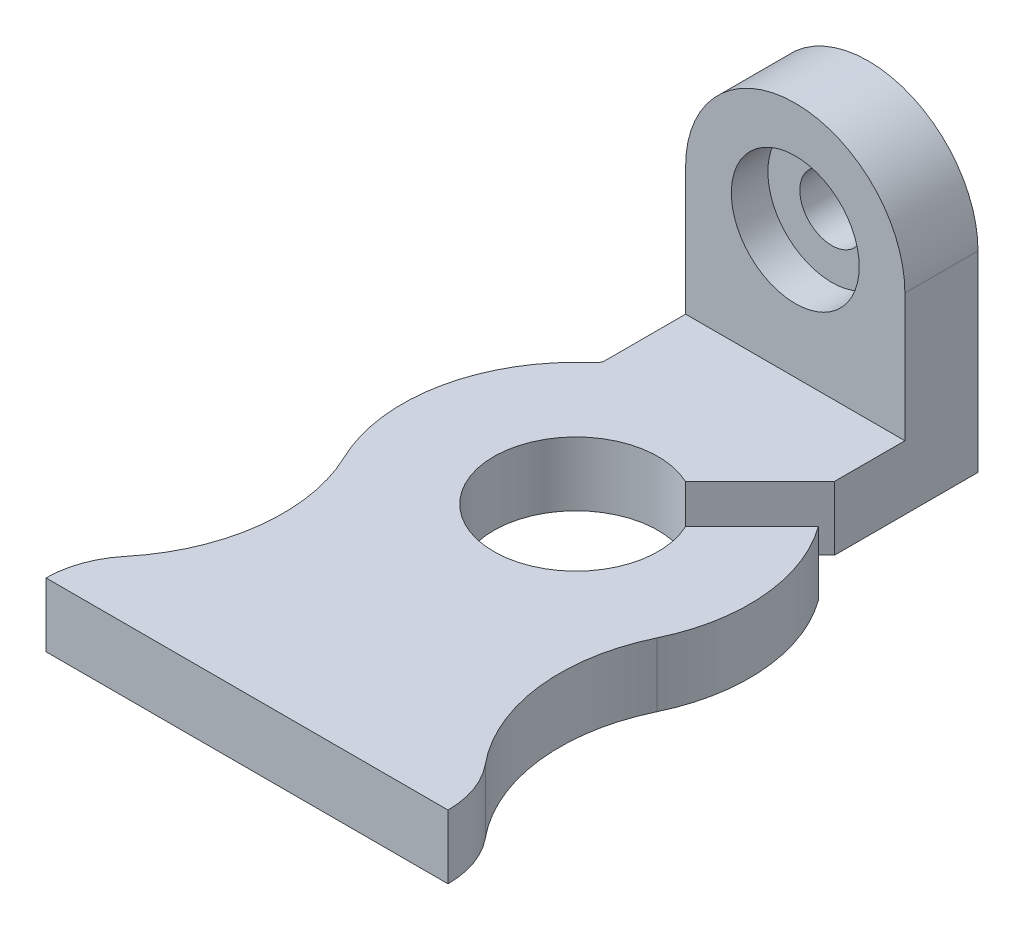
ISO-10303-21;
HEADER;
FILE_DESCRIPTION(('STEP AP214'),'2;1');
FILE_NAME('part.step','',(''),(''),'','','');
FILE_SCHEMA(('AUTOMOTIVE_DESIGN { 1 0 10303 214 1 1 1 1 }'));
ENDSEC;
DATA;
#1=APPLICATION_CONTEXT('core data for automotive mechanical design processes');
#2=APPLICATION_PROTOCOL_DEFINITION('international standard','automotive_design',2000,#1);
#3=PRODUCT_CONTEXT('',#1,'mechanical');
#4=PRODUCT('Part','Part','',(#3));
#5=PRODUCT_RELATED_PRODUCT_CATEGORY('part','',(#4));
#6=PRODUCT_DEFINITION_FORMATION('','',#4);
#7=PRODUCT_DEFINITION_CONTEXT('part definition',#1,'design');
#8=PRODUCT_DEFINITION('design','',#6,#7);
#9=PRODUCT_DEFINITION_SHAPE('','',#8);
#10=(LENGTH_UNIT() NAMED_UNIT(*) SI_UNIT(.MILLI.,.METRE.));
#11=(NAMED_UNIT(*) PLANE_ANGLE_UNIT() SI_UNIT($,.RADIAN.));
#12=(NAMED_UNIT(*) SI_UNIT($,.STERADIAN.) SOLID_ANGLE_UNIT());
#13=UNCERTAINTY_MEASURE_WITH_UNIT(LENGTH_MEASURE(1.E-05),#10,'distance_accuracy_value','');
#14=(GEOMETRIC_REPRESENTATION_CONTEXT(3) GLOBAL_UNCERTAINTY_ASSIGNED_CONTEXT((#13)) GLOBAL_UNIT_ASSIGNED_CONTEXT((#10,
#11,#12)) REPRESENTATION_CONTEXT('',''));
#15=CARTESIAN_POINT('',(0.,0.,0.));
#16=DIRECTION('',(0.,0.,1.));
#17=DIRECTION('',(1.,0.,0.));
#18=AXIS2_PLACEMENT_3D('',#15,#16,#17);
#19=CARTESIAN_POINT('',(0.,22.225,-114.3));
#20=DIRECTION('',(0.,-1.,0.));
#21=DIRECTION('',(0.,0.,-1.));
#22=AXIS2_PLACEMENT_3D('',#19,#20,#21);
#23=CYLINDRICAL_SURFACE('',#22,60.325);
#24=DIRECTION('',(0.,-1.,0.));
#25=VECTOR('',#24,1.);
#26=CARTESIAN_POINT('',(48.9316718006548,22.225,-149.58168249663));
#27=LINE('',#26,#25);
#28=CARTESIAN_POINT('',(48.9316718006548,22.225,-149.58168249663));
#29=VERTEX_POINT('',#28);
#30=CARTESIAN_POINT('',(48.9316718006548,0.,-149.58168249663));
#31=VERTEX_POINT('',#30);
#32=EDGE_CURVE('E383',#29,#31,#27,.T.);
#33=ORIENTED_EDGE('',*,*,#32,.F.);
#34=CARTESIAN_POINT('',(0.,22.225,-114.3));
#35=DIRECTION('',(0.,1.,0.));
#36=DIRECTION('',(0.,0.,1.));
#37=AXIS2_PLACEMENT_3D('',#34,#35,#36);
#38=CIRCLE('',#37,60.325);
#39=CARTESIAN_POINT('',(54.3589834488349,22.225,-88.1426579444834));
#40=VERTEX_POINT('',#39);
#41=EDGE_CURVE('E185',#40,#29,#38,.T.);
#42=ORIENTED_EDGE('',*,*,#41,.F.);
#43=DIRECTION('',(0.,-1.,0.));
#44=VECTOR('',#43,1.);
#45=CARTESIAN_POINT('',(54.3589834488349,22.225,-88.1426579444834));
#46=LINE('',#45,#44);
#47=CARTESIAN_POINT('',(54.3589834488349,0.,-88.1426579444834));
#48=VERTEX_POINT('',#47);
#49=EDGE_CURVE('E45',#40,#48,#46,.T.);
#50=ORIENTED_EDGE('',*,*,#49,.T.);
#51=CARTESIAN_POINT('',(0.,0.,-114.3));
#52=DIRECTION('',(0.,1.,0.));
#53=DIRECTION('',(0.,0.,1.));
#54=AXIS2_PLACEMENT_3D('',#51,#52,#53);
#55=CIRCLE('',#54,60.325);
#56=EDGE_CURVE('E253',#48,#31,#55,.T.);
#57=ORIENTED_EDGE('',*,*,#56,.T.);
#58=EDGE_LOOP('',(#33,#42,#50,#57));
#59=FACE_BOUND('',#58,.T.);
#60=ADVANCED_FACE('F35',(#59),#23,.T.);
#61=CARTESIAN_POINT('',(0.,66.675,-190.5));
#62=DIRECTION('',(0.,0.,-1.));
#63=DIRECTION('',(-1.,0.,0.));
#64=AXIS2_PLACEMENT_3D('',#61,#62,#63);
#65=CYLINDRICAL_SURFACE('',#64,11.1125);
#66=CARTESIAN_POINT('',(0.,66.675,-215.9));
#67=DIRECTION('',(0.,0.,-1.));
#68=DIRECTION('',(-1.,0.,0.));
#69=AXIS2_PLACEMENT_3D('',#66,#67,#68);
#70=CIRCLE('',#69,11.1125);
#71=CARTESIAN_POINT('',(-11.1125,66.675,-215.9));
#72=VERTEX_POINT('',#71);
#73=EDGE_CURVE('E212',#72,#72,#70,.T.);
#74=ORIENTED_EDGE('',*,*,#73,.T.);
#75=EDGE_LOOP('',(#74));
#76=FACE_BOUND('',#75,.T.);
#77=CARTESIAN_POINT('',(0.,66.675,-203.2));
#78=DIRECTION('',(0.,0.,1.));
#79=DIRECTION('',(1.,0.,0.));
#80=AXIS2_PLACEMENT_3D('',#77,#78,#79);
#81=CIRCLE('',#80,11.1125);
#82=CARTESIAN_POINT('',(11.1125,66.675,-203.2));
#83=VERTEX_POINT('',#82);
#84=EDGE_CURVE('E216',#83,#83,#81,.F.);
#85=ORIENTED_EDGE('',*,*,#84,.F.);
#86=EDGE_LOOP('',(#85));
#87=FACE_BOUND('',#86,.T.);
#88=ADVANCED_FACE('F335',(#76,#87),#65,.F.);
#89=CARTESIAN_POINT('',(38.1,22.225,0.));
#90=DIRECTION('',(0.,1.,0.));
#91=DIRECTION('',(0.,0.,1.));
#92=AXIS2_PLACEMENT_3D('',#89,#90,#91);
#93=PLANE('',#92);
#94=DIRECTION('',(-0.707106781186546,0.,0.707106781186549));
#95=VECTOR('',#94,1.);
#96=CARTESIAN_POINT('',(-63.9749946520126,22.225,-63.9749946520123));
#97=LINE('',#96,#95);
#98=CARTESIAN_POINT('',(38.1,22.225,-166.049989304025));
#99=VERTEX_POINT('',#98);
#100=CARTESIAN_POINT('',(12.193016823954,22.225,-140.143006127979));
#101=VERTEX_POINT('',#100);
#102=EDGE_CURVE('E61',#99,#101,#97,.T.);
#103=ORIENTED_EDGE('',*,*,#102,.F.);
#104=DIRECTION('',(0.,0.,-1.));
#105=VECTOR('',#104,1.);
#106=CARTESIAN_POINT('',(38.1,22.225,-215.9));
#107=LINE('',#106,#105);
#108=CARTESIAN_POINT('',(38.1,22.225,-190.5));
#109=VERTEX_POINT('',#108);
#110=EDGE_CURVE('E39',#99,#109,#107,.T.);
#111=ORIENTED_EDGE('',*,*,#110,.T.);
#112=DIRECTION('',(1.,0.,0.));
#113=VECTOR('',#112,1.);
#114=CARTESIAN_POINT('',(0.,22.225,-190.5));
#115=LINE('',#114,#113);
#116=CARTESIAN_POINT('',(-38.1,22.225,-190.5));
#117=VERTEX_POINT('',#116);
#118=EDGE_CURVE('E199',#117,#109,#115,.T.);
#119=ORIENTED_EDGE('',*,*,#118,.F.);
#120=DIRECTION('',(0.,0.,1.));
#121=VECTOR('',#120,1.);
#122=CARTESIAN_POINT('',(-38.1,22.225,-215.9));
#123=LINE('',#122,#121);
#124=CARTESIAN_POINT('',(-38.1,22.225,-162.555822187587));
#125=VERTEX_POINT('',#124);
#126=EDGE_CURVE('E194',#117,#125,#123,.T.);
#127=ORIENTED_EDGE('',*,*,#126,.T.);
#128=CARTESIAN_POINT('',(-41.275,22.225,-162.555822187587));
#129=DIRECTION('',(0.,-1.,0.));
#130=DIRECTION('',(0.,0.,1.));
#131=AXIS2_PLACEMENT_3D('',#128,#129,#130);
#132=CIRCLE('',#131,3.17500000000001);
#133=CARTESIAN_POINT('',(-39.21125,22.225,-160.143031078207));
#134=VERTEX_POINT('',#133);
#135=EDGE_CURVE('E191',#125,#134,#132,.T.);
#136=ORIENTED_EDGE('',*,*,#135,.T.);
#137=CARTESIAN_POINT('',(0.,22.225,-114.3));
#138=DIRECTION('',(0.,1.,0.));
#139=DIRECTION('',(0.,0.,-1.));
#140=AXIS2_PLACEMENT_3D('',#137,#138,#139);
#141=CIRCLE('',#140,60.325);
#142=CARTESIAN_POINT('',(-54.3589834488349,22.225,-88.1426579444834));
#143=VERTEX_POINT('',#142);
#144=EDGE_CURVE('E293',#134,#143,#141,.T.);
#145=ORIENTED_EDGE('',*,*,#144,.T.);
#146=CARTESIAN_POINT('',(-111.578966026556,22.225,-60.6086136755186));
#147=DIRECTION('',(0.,-1.,0.));
#148=DIRECTION('',(0.,0.,-1.));
#149=AXIS2_PLACEMENT_3D('',#146,#147,#148);
#150=CIRCLE('',#149,63.5);
#151=CARTESIAN_POINT('',(-62.5929886755186,22.225,-20.2028712251729));
#152=VERTEX_POINT('',#151);
#153=EDGE_CURVE('E311',#143,#152,#150,.T.);
#154=ORIENTED_EDGE('',*,*,#153,.T.);
#155=CARTESIAN_POINT('',(-38.1,22.225,0.));
#156=DIRECTION('',(0.,1.,0.));
#157=DIRECTION('',(0.,0.,-1.));
#158=AXIS2_PLACEMENT_3D('',#155,#156,#157);
#159=CIRCLE('',#158,31.75);
#160=CARTESIAN_POINT('',(-69.85,22.225,0.));
#161=VERTEX_POINT('',#160);
#162=EDGE_CURVE('E308',#152,#161,#159,.T.);
#163=ORIENTED_EDGE('',*,*,#162,.T.);
#164=DIRECTION('',(1.,0.,0.));
#165=VECTOR('',#164,1.);
#166=CARTESIAN_POINT('',(-69.85,22.225,0.));
#167=LINE('',#166,#165);
#168=CARTESIAN_POINT('',(69.85,22.225,0.));
#169=VERTEX_POINT('',#168);
#170=EDGE_CURVE('E278',#161,#169,#167,.T.);
#171=ORIENTED_EDGE('',*,*,#170,.T.);
#172=CARTESIAN_POINT('',(38.1,22.225,0.));
#173=DIRECTION('',(0.,1.,0.));
#174=DIRECTION('',(0.,0.,1.));
#175=AXIS2_PLACEMENT_3D('',#172,#173,#174);
#176=CIRCLE('',#175,31.75);
#177=CARTESIAN_POINT('',(62.5929886755186,22.225,-20.2028712251729));
#178=VERTEX_POINT('',#177);
#179=EDGE_CURVE('E179',#169,#178,#176,.T.);
#180=ORIENTED_EDGE('',*,*,#179,.T.);
#181=CARTESIAN_POINT('',(111.578966026556,22.225,-60.6086136755186));
#182=DIRECTION('',(0.,-1.,0.));
#183=DIRECTION('',(0.,0.,1.));
#184=AXIS2_PLACEMENT_3D('',#181,#182,#183);
#185=CIRCLE('',#184,63.5);
#186=EDGE_CURVE('E182',#178,#40,#185,.T.);
#187=ORIENTED_EDGE('',*,*,#186,.T.);
#188=ORIENTED_EDGE('',*,*,#41,.T.);
#189=DIRECTION('',(-0.707106781186546,0.,0.707106781186549));
#190=VECTOR('',#189,1.);
#191=CARTESIAN_POINT('',(-50.3250053479874,22.225,-50.3250053479872));
#192=LINE('',#191,#190);
#193=CARTESIAN_POINT('',(25.8430061279792,22.225,-126.493016823954));
#194=VERTEX_POINT('',#193);
#195=EDGE_CURVE('E166',#29,#194,#192,.T.);
#196=ORIENTED_EDGE('',*,*,#195,.T.);
#197=CARTESIAN_POINT('',(0.,22.225,-114.3));
#198=DIRECTION('',(0.,1.,0.));
#199=DIRECTION('',(0.,0.,1.));
#200=AXIS2_PLACEMENT_3D('',#197,#198,#199);
#201=CIRCLE('',#200,28.575);
#202=EDGE_CURVE('E169',#101,#194,#201,.T.);
#203=ORIENTED_EDGE('',*,*,#202,.F.);
#204=EDGE_LOOP('',(#103,#111,#119,#127,#136,#145,#154,#163,#171,#180,#187,#188,#196,#203));
#205=FACE_BOUND('',#204,.T.);
#206=ADVANCED_FACE('F322',(#205),#93,.T.);
#207=CARTESIAN_POINT('',(38.1,0.,0.));
#208=DIRECTION('',(0.,1.,0.));
#209=DIRECTION('',(0.,0.,1.));
#210=AXIS2_PLACEMENT_3D('',#207,#208,#209);
#211=PLANE('',#210);
#212=DIRECTION('',(0.,0.,-1.));
#213=VECTOR('',#212,1.);
#214=CARTESIAN_POINT('',(38.1,0.,-215.9));
#215=LINE('',#214,#213);
#216=CARTESIAN_POINT('',(38.1,0.,-166.049989304025));
#217=VERTEX_POINT('',#216);
#218=CARTESIAN_POINT('',(38.1,0.,-215.9));
#219=VERTEX_POINT('',#218);
#220=EDGE_CURVE('E165',#217,#219,#215,.T.);
#221=ORIENTED_EDGE('',*,*,#220,.F.);
#222=DIRECTION('',(-0.707106781186546,0.,0.707106781186549));
#223=VECTOR('',#222,1.);
#224=CARTESIAN_POINT('',(-63.9749946520126,0.,-63.9749946520123));
#225=LINE('',#224,#223);
#226=CARTESIAN_POINT('',(12.193016823954,0.,-140.143006127979));
#227=VERTEX_POINT('',#226);
#228=EDGE_CURVE('E151',#217,#227,#225,.T.);
#229=ORIENTED_EDGE('',*,*,#228,.T.);
#230=CARTESIAN_POINT('',(0.,0.,-114.3));
#231=DIRECTION('',(0.,1.,0.));
#232=DIRECTION('',(0.,0.,1.));
#233=AXIS2_PLACEMENT_3D('',#230,#231,#232);
#234=CIRCLE('',#233,28.575);
#235=CARTESIAN_POINT('',(25.8430061279792,0.,-126.493016823954));
#236=VERTEX_POINT('',#235);
#237=EDGE_CURVE('E163',#227,#236,#234,.T.);
#238=ORIENTED_EDGE('',*,*,#237,.T.);
#239=DIRECTION('',(-0.707106781186546,0.,0.707106781186549));
#240=VECTOR('',#239,1.);
#241=CARTESIAN_POINT('',(-50.3250053479874,0.,-50.3250053479872));
#242=LINE('',#241,#240);
#243=EDGE_CURVE('E53',#31,#236,#242,.T.);
#244=ORIENTED_EDGE('',*,*,#243,.F.);
#245=ORIENTED_EDGE('',*,*,#56,.F.);
#246=CARTESIAN_POINT('',(111.578966026556,0.,-60.6086136755186));
#247=DIRECTION('',(0.,-1.,0.));
#248=DIRECTION('',(0.,0.,1.));
#249=AXIS2_PLACEMENT_3D('',#246,#247,#248);
#250=CIRCLE('',#249,63.5);
#251=CARTESIAN_POINT('',(62.5929886755186,0.,-20.2028712251729));
#252=VERTEX_POINT('',#251);
#253=EDGE_CURVE('E256',#252,#48,#250,.T.);
#254=ORIENTED_EDGE('',*,*,#253,.F.);
#255=CARTESIAN_POINT('',(38.1,0.,0.));
#256=DIRECTION('',(0.,1.,0.));
#257=DIRECTION('',(0.,0.,1.));
#258=AXIS2_PLACEMENT_3D('',#255,#256,#257);
#259=CIRCLE('',#258,31.75);
#260=CARTESIAN_POINT('',(69.85,0.,0.));
#261=VERTEX_POINT('',#260);
#262=EDGE_CURVE('E172',#261,#252,#259,.T.);
#263=ORIENTED_EDGE('',*,*,#262,.F.);
#264=DIRECTION('',(1.,0.,0.));
#265=VECTOR('',#264,1.);
#266=CARTESIAN_POINT('',(-69.85,0.,0.));
#267=LINE('',#266,#265);
#268=CARTESIAN_POINT('',(-69.85,0.,0.));
#269=VERTEX_POINT('',#268);
#270=EDGE_CURVE('E183',#269,#261,#267,.T.);
#271=ORIENTED_EDGE('',*,*,#270,.F.);
#272=CARTESIAN_POINT('',(-38.1,0.,0.));
#273=DIRECTION('',(0.,1.,0.));
#274=DIRECTION('',(0.,0.,-1.));
#275=AXIS2_PLACEMENT_3D('',#272,#273,#274);
#276=CIRCLE('',#275,31.75);
#277=CARTESIAN_POINT('',(-62.5929886755186,0.,-20.2028712251729));
#278=VERTEX_POINT('',#277);
#279=EDGE_CURVE('E271',#278,#269,#276,.T.);
#280=ORIENTED_EDGE('',*,*,#279,.F.);
#281=CARTESIAN_POINT('',(-111.578966026556,0.,-60.6086136755186));
#282=DIRECTION('',(0.,-1.,0.));
#283=DIRECTION('',(0.,0.,-1.));
#284=AXIS2_PLACEMENT_3D('',#281,#282,#283);
#285=CIRCLE('',#284,63.5);
#286=CARTESIAN_POINT('',(-54.3589834488349,0.,-88.1426579444834));
#287=VERTEX_POINT('',#286);
#288=EDGE_CURVE('E269',#287,#278,#285,.T.);
#289=ORIENTED_EDGE('',*,*,#288,.F.);
#290=CARTESIAN_POINT('',(0.,0.,-114.3));
#291=DIRECTION('',(0.,1.,0.));
#292=DIRECTION('',(0.,0.,-1.));
#293=AXIS2_PLACEMENT_3D('',#290,#291,#292);
#294=CIRCLE('',#293,60.325);
#295=CARTESIAN_POINT('',(-39.21125,0.,-160.143031078207));
#296=VERTEX_POINT('',#295);
#297=EDGE_CURVE('E267',#296,#287,#294,.T.);
#298=ORIENTED_EDGE('',*,*,#297,.F.);
#299=CARTESIAN_POINT('',(-41.275,0.,-162.555822187587));
#300=DIRECTION('',(0.,-1.,0.));
#301=DIRECTION('',(0.,0.,1.));
#302=AXIS2_PLACEMENT_3D('',#299,#300,#301);
#303=CIRCLE('',#302,3.17500000000001);
#304=CARTESIAN_POINT('',(-38.1,0.,-162.555822187587));
#305=VERTEX_POINT('',#304);
#306=EDGE_CURVE('E265',#305,#296,#303,.T.);
#307=ORIENTED_EDGE('',*,*,#306,.F.);
#308=DIRECTION('',(0.,0.,1.));
#309=VECTOR('',#308,1.);
#310=CARTESIAN_POINT('',(-38.1,0.,-215.9));
#311=LINE('',#310,#309);
#312=CARTESIAN_POINT('',(-38.1,0.,-215.9));
#313=VERTEX_POINT('',#312);
#314=EDGE_CURVE('E263',#313,#305,#311,.T.);
#315=ORIENTED_EDGE('',*,*,#314,.F.);
#316=DIRECTION('',(-1.,0.,0.));
#317=VECTOR('',#316,1.);
#318=CARTESIAN_POINT('',(-38.1,0.,-215.9));
#319=LINE('',#318,#317);
#320=EDGE_CURVE('E238',#219,#313,#319,.T.);
#321=ORIENTED_EDGE('',*,*,#320,.F.);
#322=EDGE_LOOP('',(#221,#229,#238,#244,#245,#254,#263,#271,#280,#289,#298,#307,#315,#321));
#323=FACE_BOUND('',#322,.T.);
#324=ADVANCED_FACE('F162',(#323),#211,.F.);
#325=CARTESIAN_POINT('',(38.1,22.225,0.));
#326=DIRECTION('',(0.,-1.,0.));
#327=DIRECTION('',(0.,0.,-1.));
#328=AXIS2_PLACEMENT_3D('',#325,#326,#327);
#329=CYLINDRICAL_SURFACE('',#328,31.75);
#330=ORIENTED_EDGE('',*,*,#262,.T.);
#331=DIRECTION('',(0.,-1.,0.));
#332=VECTOR('',#331,1.);
#333=CARTESIAN_POINT('',(62.5929886755186,22.225,-20.2028712251729));
#334=LINE('',#333,#332);
#335=EDGE_CURVE('E11',#178,#252,#334,.T.);
#336=ORIENTED_EDGE('',*,*,#335,.F.);
#337=ORIENTED_EDGE('',*,*,#179,.F.);
#338=DIRECTION('',(0.,-1.,0.));
#339=VECTOR('',#338,1.);
#340=CARTESIAN_POINT('',(69.85,22.225,0.));
#341=LINE('',#340,#339);
#342=EDGE_CURVE('E274',#169,#261,#341,.T.);
#343=ORIENTED_EDGE('',*,*,#342,.T.);
#344=EDGE_LOOP('',(#330,#336,#337,#343));
#345=FACE_BOUND('',#344,.T.);
#346=ADVANCED_FACE('F37',(#345),#329,.T.);
#347=CARTESIAN_POINT('',(111.578966026556,22.225,-60.6086136755186));
#348=DIRECTION('',(0.,-1.,0.));
#349=DIRECTION('',(0.,0.,-1.));
#350=AXIS2_PLACEMENT_3D('',#347,#348,#349);
#351=CYLINDRICAL_SURFACE('',#350,63.5);
#352=ORIENTED_EDGE('',*,*,#253,.T.);
#353=ORIENTED_EDGE('',*,*,#49,.F.);
#354=ORIENTED_EDGE('',*,*,#186,.F.);
#355=ORIENTED_EDGE('',*,*,#335,.T.);
#356=EDGE_LOOP('',(#352,#353,#354,#355));
#357=FACE_BOUND('',#356,.T.);
#358=ADVANCED_FACE('F324',(#357),#351,.F.);
#359=CARTESIAN_POINT('',(38.1,22.225,-215.9));
#360=DIRECTION('',(-1.,0.,0.));
#361=DIRECTION('',(0.,0.,1.));
#362=AXIS2_PLACEMENT_3D('',#359,#360,#361);
#363=PLANE('',#362);
#364=ORIENTED_EDGE('',*,*,#110,.F.);
#365=DIRECTION('',(0.,-1.,0.));
#366=VECTOR('',#365,1.);
#367=CARTESIAN_POINT('',(38.1,22.225,-166.049989304025));
#368=LINE('',#367,#366);
#369=EDGE_CURVE('E384',#99,#217,#368,.T.);
#370=ORIENTED_EDGE('',*,*,#369,.T.);
#371=ORIENTED_EDGE('',*,*,#220,.T.);
#372=DIRECTION('',(0.,-1.,0.));
#373=VECTOR('',#372,1.);
#374=CARTESIAN_POINT('',(38.1,22.225,-215.9));
#375=LINE('',#374,#373);
#376=CARTESIAN_POINT('',(38.1,66.675,-215.9));
#377=VERTEX_POINT('',#376);
#378=EDGE_CURVE('E237',#377,#219,#375,.T.);
#379=ORIENTED_EDGE('',*,*,#378,.F.);
#380=DIRECTION('',(0.,0.,-1.));
#381=VECTOR('',#380,1.);
#382=CARTESIAN_POINT('',(38.1,66.675,-190.5));
#383=LINE('',#382,#381);
#384=CARTESIAN_POINT('',(38.1,66.675,-190.5));
#385=VERTEX_POINT('',#384);
#386=EDGE_CURVE('E170',#385,#377,#383,.T.);
#387=ORIENTED_EDGE('',*,*,#386,.F.);
#388=DIRECTION('',(0.,1.,0.));
#389=VECTOR('',#388,1.);
#390=CARTESIAN_POINT('',(38.1,0.,-190.5));
#391=LINE('',#390,#389);
#392=EDGE_CURVE('E197',#109,#385,#391,.T.);
#393=ORIENTED_EDGE('',*,*,#392,.F.);
#394=EDGE_LOOP('',(#364,#370,#371,#379,#387,#393));
#395=FACE_BOUND('',#394,.T.);
#396=ADVANCED_FACE('F326',(#395),#363,.F.);
#397=CARTESIAN_POINT('',(-38.1,22.225,-215.9));
#398=DIRECTION('',(0.,0.,1.));
#399=DIRECTION('',(1.,0.,0.));
#400=AXIS2_PLACEMENT_3D('',#397,#398,#399);
#401=PLANE('',#400);
#402=ORIENTED_EDGE('',*,*,#320,.T.);
#403=DIRECTION('',(0.,-1.,0.));
#404=VECTOR('',#403,1.);
#405=CARTESIAN_POINT('',(-38.1,22.225,-215.9));
#406=LINE('',#405,#404);
#407=CARTESIAN_POINT('',(-38.1,66.675,-215.9));
#408=VERTEX_POINT('',#407);
#409=EDGE_CURVE('E224',#408,#313,#406,.T.);
#410=ORIENTED_EDGE('',*,*,#409,.F.);
#411=CARTESIAN_POINT('',(0.,66.675,-215.9));
#412=DIRECTION('',(0.,0.,-1.));
#413=DIRECTION('',(-1.,0.,0.));
#414=AXIS2_PLACEMENT_3D('',#411,#412,#413);
#415=CIRCLE('',#414,38.1);
#416=EDGE_CURVE('E215',#408,#377,#415,.T.);
#417=ORIENTED_EDGE('',*,*,#416,.T.);
#418=ORIENTED_EDGE('',*,*,#378,.T.);
#419=EDGE_LOOP('',(#402,#410,#417,#418));
#420=FACE_BOUND('',#419,.T.);
#421=ORIENTED_EDGE('',*,*,#73,.F.);
#422=EDGE_LOOP('',(#421));
#423=FACE_BOUND('',#422,.T.);
#424=ADVANCED_FACE('F235',(#420,#423),#401,.F.);
#425=CARTESIAN_POINT('',(-38.1,22.225,-215.9));
#426=DIRECTION('',(1.,0.,0.));
#427=DIRECTION('',(0.,0.,-1.));
#428=AXIS2_PLACEMENT_3D('',#425,#426,#427);
#429=PLANE('',#428);
#430=ORIENTED_EDGE('',*,*,#314,.T.);
#431=DIRECTION('',(0.,-1.,0.));
#432=VECTOR('',#431,1.);
#433=CARTESIAN_POINT('',(-38.1,22.225,-162.555822187587));
#434=LINE('',#433,#432);
#435=EDGE_CURVE('E239',#125,#305,#434,.T.);
#436=ORIENTED_EDGE('',*,*,#435,.F.);
#437=ORIENTED_EDGE('',*,*,#126,.F.);
#438=DIRECTION('',(0.,1.,0.));
#439=VECTOR('',#438,1.);
#440=CARTESIAN_POINT('',(-38.1,0.,-190.5));
#441=LINE('',#440,#439);
#442=CARTESIAN_POINT('',(-38.1,66.675,-190.5));
#443=VERTEX_POINT('',#442);
#444=EDGE_CURVE('E206',#117,#443,#441,.T.);
#445=ORIENTED_EDGE('',*,*,#444,.T.);
#446=DIRECTION('',(0.,0.,-1.));
#447=VECTOR('',#446,1.);
#448=CARTESIAN_POINT('',(-38.1,66.675,-190.5));
#449=LINE('',#448,#447);
#450=EDGE_CURVE('E175',#443,#408,#449,.T.);
#451=ORIENTED_EDGE('',*,*,#450,.T.);
#452=ORIENTED_EDGE('',*,*,#409,.T.);
#453=EDGE_LOOP('',(#430,#436,#437,#445,#451,#452));
#454=FACE_BOUND('',#453,.T.);
#455=ADVANCED_FACE('F223',(#454),#429,.F.);
#456=CARTESIAN_POINT('',(-41.275,22.225,-162.555822187587));
#457=DIRECTION('',(0.,-1.,0.));
#458=DIRECTION('',(0.,0.,-1.));
#459=AXIS2_PLACEMENT_3D('',#456,#457,#458);
#460=CYLINDRICAL_SURFACE('',#459,3.17500000000001);
#461=ORIENTED_EDGE('',*,*,#306,.T.);
#462=DIRECTION('',(0.,-1.,0.));
#463=VECTOR('',#462,1.);
#464=CARTESIAN_POINT('',(-39.21125,22.225,-160.143031078207));
#465=LINE('',#464,#463);
#466=EDGE_CURVE('E243',#134,#296,#465,.T.);
#467=ORIENTED_EDGE('',*,*,#466,.F.);
#468=ORIENTED_EDGE('',*,*,#135,.F.);
#469=ORIENTED_EDGE('',*,*,#435,.T.);
#470=EDGE_LOOP('',(#461,#467,#468,#469));
#471=FACE_BOUND('',#470,.T.);
#472=ADVANCED_FACE('F346',(#471),#460,.F.);
#473=CARTESIAN_POINT('',(0.,22.225,-114.3));
#474=DIRECTION('',(0.,-1.,0.));
#475=DIRECTION('',(0.,0.,-1.));
#476=AXIS2_PLACEMENT_3D('',#473,#474,#475);
#477=CYLINDRICAL_SURFACE('',#476,60.325);
#478=ORIENTED_EDGE('',*,*,#297,.T.);
#479=DIRECTION('',(0.,-1.,0.));
#480=VECTOR('',#479,1.);
#481=CARTESIAN_POINT('',(-54.3589834488349,22.225,-88.1426579444834));
#482=LINE('',#481,#480);
#483=EDGE_CURVE('E284',#143,#287,#482,.T.);
#484=ORIENTED_EDGE('',*,*,#483,.F.);
#485=ORIENTED_EDGE('',*,*,#144,.F.);
#486=ORIENTED_EDGE('',*,*,#466,.T.);
#487=EDGE_LOOP('',(#478,#484,#485,#486));
#488=FACE_BOUND('',#487,.T.);
#489=ADVANCED_FACE('F291',(#488),#477,.T.);
#490=CARTESIAN_POINT('',(-111.578966026556,22.225,-60.6086136755186));
#491=DIRECTION('',(0.,-1.,0.));
#492=DIRECTION('',(0.,0.,-1.));
#493=AXIS2_PLACEMENT_3D('',#490,#491,#492);
#494=CYLINDRICAL_SURFACE('',#493,63.5);
#495=ORIENTED_EDGE('',*,*,#288,.T.);
#496=DIRECTION('',(0.,-1.,0.));
#497=VECTOR('',#496,1.);
#498=CARTESIAN_POINT('',(-62.5929886755186,22.225,-20.2028712251729));
#499=LINE('',#498,#497);
#500=EDGE_CURVE('E281',#152,#278,#499,.T.);
#501=ORIENTED_EDGE('',*,*,#500,.F.);
#502=ORIENTED_EDGE('',*,*,#153,.F.);
#503=ORIENTED_EDGE('',*,*,#483,.T.);
#504=EDGE_LOOP('',(#495,#501,#502,#503));
#505=FACE_BOUND('',#504,.T.);
#506=ADVANCED_FACE('F302',(#505),#494,.F.);
#507=CARTESIAN_POINT('',(-38.1,22.225,0.));
#508=DIRECTION('',(0.,-1.,0.));
#509=DIRECTION('',(0.,0.,-1.));
#510=AXIS2_PLACEMENT_3D('',#507,#508,#509);
#511=CYLINDRICAL_SURFACE('',#510,31.75);
#512=ORIENTED_EDGE('',*,*,#279,.T.);
#513=DIRECTION('',(0.,-1.,0.));
#514=VECTOR('',#513,1.);
#515=CARTESIAN_POINT('',(-69.85,22.225,0.));
#516=LINE('',#515,#514);
#517=EDGE_CURVE('E277',#161,#269,#516,.T.);
#518=ORIENTED_EDGE('',*,*,#517,.F.);
#519=ORIENTED_EDGE('',*,*,#162,.F.);
#520=ORIENTED_EDGE('',*,*,#500,.T.);
#521=EDGE_LOOP('',(#512,#518,#519,#520));
#522=FACE_BOUND('',#521,.T.);
#523=ADVANCED_FACE('F306',(#522),#511,.T.);
#524=CARTESIAN_POINT('',(-69.85,22.225,0.));
#525=DIRECTION('',(0.,0.,-1.));
#526=DIRECTION('',(-1.,0.,0.));
#527=AXIS2_PLACEMENT_3D('',#524,#525,#526);
#528=PLANE('',#527);
#529=ORIENTED_EDGE('',*,*,#270,.T.);
#530=ORIENTED_EDGE('',*,*,#342,.F.);
#531=ORIENTED_EDGE('',*,*,#170,.F.);
#532=ORIENTED_EDGE('',*,*,#517,.T.);
#533=EDGE_LOOP('',(#529,#530,#531,#532));
#534=FACE_BOUND('',#533,.T.);
#535=ADVANCED_FACE('F321',(#534),#528,.F.);
#536=CARTESIAN_POINT('',(0.,22.225,-114.3));
#537=DIRECTION('',(0.,-1.,0.));
#538=DIRECTION('',(0.,0.,-1.));
#539=AXIS2_PLACEMENT_3D('',#536,#537,#538);
#540=CYLINDRICAL_SURFACE('',#539,28.575);
#541=DIRECTION('',(0.,1.,0.));
#542=VECTOR('',#541,1.);
#543=CARTESIAN_POINT('',(12.193016823954,0.,-140.143006127979));
#544=LINE('',#543,#542);
#545=EDGE_CURVE('E148',#227,#101,#544,.T.);
#546=ORIENTED_EDGE('',*,*,#545,.T.);
#547=ORIENTED_EDGE('',*,*,#202,.T.);
#548=DIRECTION('',(0.,1.,0.));
#549=VECTOR('',#548,1.);
#550=CARTESIAN_POINT('',(25.8430061279792,0.,-126.493016823954));
#551=LINE('',#550,#549);
#552=EDGE_CURVE('E157',#236,#194,#551,.T.);
#553=ORIENTED_EDGE('',*,*,#552,.F.);
#554=ORIENTED_EDGE('',*,*,#237,.F.);
#555=EDGE_LOOP('',(#546,#547,#553,#554));
#556=FACE_BOUND('',#555,.T.);
#557=ADVANCED_FACE('F168',(#556),#540,.F.);
#558=CARTESIAN_POINT('',(0.,66.675,-190.5));
#559=DIRECTION('',(0.,0.,-1.));
#560=DIRECTION('',(-1.,0.,0.));
#561=AXIS2_PLACEMENT_3D('',#558,#559,#560);
#562=CYLINDRICAL_SURFACE('',#561,38.1);
#563=ORIENTED_EDGE('',*,*,#416,.F.);
#564=ORIENTED_EDGE('',*,*,#450,.F.);
#565=CARTESIAN_POINT('',(0.,66.675,-190.5));
#566=DIRECTION('',(0.,0.,-1.));
#567=DIRECTION('',(-1.,0.,0.));
#568=AXIS2_PLACEMENT_3D('',#565,#566,#567);
#569=CIRCLE('',#568,38.1);
#570=EDGE_CURVE('E200',#443,#385,#569,.T.);
#571=ORIENTED_EDGE('',*,*,#570,.T.);
#572=ORIENTED_EDGE('',*,*,#386,.T.);
#573=EDGE_LOOP('',(#563,#564,#571,#572));
#574=FACE_BOUND('',#573,.T.);
#575=ADVANCED_FACE('F231',(#574),#562,.T.);
#576=CARTESIAN_POINT('',(0.,0.,-190.5));
#577=DIRECTION('',(0.,0.,-1.));
#578=DIRECTION('',(-1.,0.,0.));
#579=AXIS2_PLACEMENT_3D('',#576,#577,#578);
#580=PLANE('',#579);
#581=CARTESIAN_POINT('',(0.,66.675,-190.5));
#582=DIRECTION('',(0.,0.,1.));
#583=DIRECTION('',(1.,0.,0.));
#584=AXIS2_PLACEMENT_3D('',#581,#582,#583);
#585=CIRCLE('',#584,22.225);
#586=CARTESIAN_POINT('',(22.225,66.675,-190.5));
#587=VERTEX_POINT('',#586);
#588=EDGE_CURVE('E386',#587,#587,#585,.T.);
#589=ORIENTED_EDGE('',*,*,#588,.F.);
#590=EDGE_LOOP('',(#589));
#591=FACE_BOUND('',#590,.T.);
#592=ORIENTED_EDGE('',*,*,#444,.F.);
#593=ORIENTED_EDGE('',*,*,#118,.T.);
#594=ORIENTED_EDGE('',*,*,#392,.T.);
#595=ORIENTED_EDGE('',*,*,#570,.F.);
#596=EDGE_LOOP('',(#592,#593,#594,#595));
#597=FACE_BOUND('',#596,.T.);
#598=ADVANCED_FACE('F365',(#591,#597),#580,.F.);
#599=CARTESIAN_POINT('',(0.,66.675,-203.2));
#600=DIRECTION('',(0.,0.,1.));
#601=DIRECTION('',(1.,0.,0.));
#602=AXIS2_PLACEMENT_3D('',#599,#600,#601);
#603=PLANE('',#602);
#604=CARTESIAN_POINT('',(0.,66.675,-203.2));
#605=DIRECTION('',(0.,0.,1.));
#606=DIRECTION('',(1.,0.,0.));
#607=AXIS2_PLACEMENT_3D('',#604,#605,#606);
#608=CIRCLE('',#607,22.225);
#609=CARTESIAN_POINT('',(22.225,66.675,-203.2));
#610=VERTEX_POINT('',#609);
#611=EDGE_CURVE('E390',#610,#610,#608,.T.);
#612=ORIENTED_EDGE('',*,*,#611,.T.);
#613=EDGE_LOOP('',(#612));
#614=FACE_BOUND('',#613,.T.);
#615=ORIENTED_EDGE('',*,*,#84,.T.);
#616=EDGE_LOOP('',(#615));
#617=FACE_BOUND('',#616,.T.);
#618=ADVANCED_FACE('F368',(#614,#617),#603,.T.);
#619=CARTESIAN_POINT('',(0.,66.675,-203.2));
#620=DIRECTION('',(0.,0.,1.));
#621=DIRECTION('',(1.,0.,0.));
#622=AXIS2_PLACEMENT_3D('',#619,#620,#621);
#623=CYLINDRICAL_SURFACE('',#622,22.225);
#624=ORIENTED_EDGE('',*,*,#611,.F.);
#625=EDGE_LOOP('',(#624));
#626=FACE_BOUND('',#625,.T.);
#627=ORIENTED_EDGE('',*,*,#588,.T.);
#628=EDGE_LOOP('',(#627));
#629=FACE_BOUND('',#628,.T.);
#630=ADVANCED_FACE('F370',(#626,#629),#623,.F.);
#631=CARTESIAN_POINT('',(-50.3250053479874,0.,-50.3250053479872));
#632=DIRECTION('',(-0.707106781186549,0.,-0.707106781186546));
#633=DIRECTION('',(-0.707106781186546,0.,0.707106781186549));
#634=AXIS2_PLACEMENT_3D('',#631,#632,#633);
#635=PLANE('',#634);
#636=ORIENTED_EDGE('',*,*,#32,.T.);
#637=ORIENTED_EDGE('',*,*,#243,.T.);
#638=ORIENTED_EDGE('',*,*,#552,.T.);
#639=ORIENTED_EDGE('',*,*,#195,.F.);
#640=EDGE_LOOP('',(#636,#637,#638,#639));
#641=FACE_BOUND('',#640,.T.);
#642=ADVANCED_FACE('F373',(#641),#635,.T.);
#643=CARTESIAN_POINT('',(-63.9749946520126,0.,-63.9749946520123));
#644=DIRECTION('',(-0.707106781186549,0.,-0.707106781186546));
#645=DIRECTION('',(-0.707106781186546,0.,0.707106781186549));
#646=AXIS2_PLACEMENT_3D('',#643,#644,#645);
#647=PLANE('',#646);
#648=ORIENTED_EDGE('',*,*,#102,.T.);
#649=ORIENTED_EDGE('',*,*,#545,.F.);
#650=ORIENTED_EDGE('',*,*,#228,.F.);
#651=ORIENTED_EDGE('',*,*,#369,.F.);
#652=EDGE_LOOP('',(#648,#649,#650,#651));
#653=FACE_BOUND('',#652,.T.);
#654=ADVANCED_FACE('F150',(#653),#647,.F.);
#655=CLOSED_SHELL('',(#60,#88,#206,#324,#346,#358,#396,#424,#455,#472,#489,#506,#523,#535,#557,
#575,#598,#618,#630,#642,#654));
#656=MANIFOLD_SOLID_BREP('B2',#655);
#657=ADVANCED_BREP_SHAPE_REPRESENTATION('',(#18,#656),#14);
#658=SHAPE_DEFINITION_REPRESENTATION(#9,#657);
ENDSEC;
END-ISO-10303-21;
